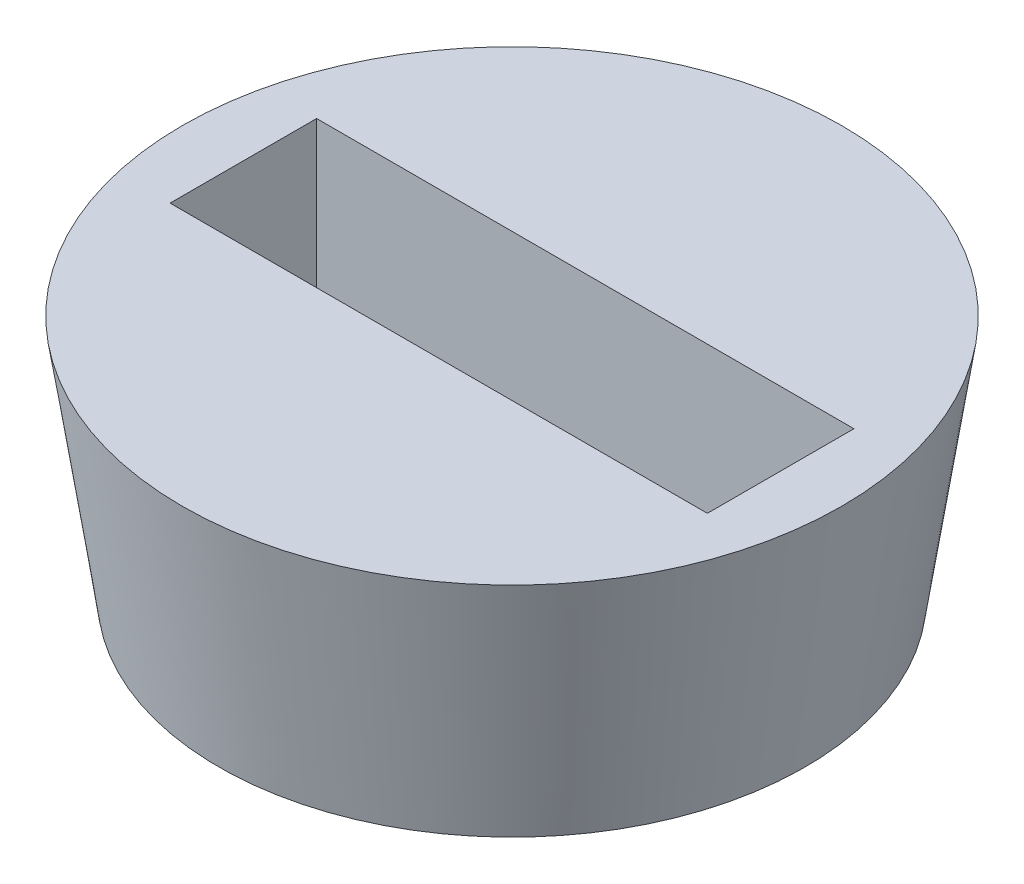
ISO-10303-21;
HEADER;
FILE_DESCRIPTION(('STEP AP214'),'2;1');
FILE_NAME('part.step','',(''),(''),'','','');
FILE_SCHEMA(('AUTOMOTIVE_DESIGN { 1 0 10303 214 1 1 1 1 }'));
ENDSEC;
DATA;
#1=APPLICATION_CONTEXT('core data for automotive mechanical design processes');
#2=APPLICATION_PROTOCOL_DEFINITION('international standard','automotive_design',2000,#1);
#3=PRODUCT_CONTEXT('',#1,'mechanical');
#4=PRODUCT('Part','Part','',(#3));
#5=PRODUCT_RELATED_PRODUCT_CATEGORY('part','',(#4));
#6=PRODUCT_DEFINITION_FORMATION('','',#4);
#7=PRODUCT_DEFINITION_CONTEXT('part definition',#1,'design');
#8=PRODUCT_DEFINITION('design','',#6,#7);
#9=PRODUCT_DEFINITION_SHAPE('','',#8);
#10=(LENGTH_UNIT() NAMED_UNIT(*) SI_UNIT(.MILLI.,.METRE.));
#11=(NAMED_UNIT(*) PLANE_ANGLE_UNIT() SI_UNIT($,.RADIAN.));
#12=(NAMED_UNIT(*) SI_UNIT($,.STERADIAN.) SOLID_ANGLE_UNIT());
#13=UNCERTAINTY_MEASURE_WITH_UNIT(LENGTH_MEASURE(1.E-05),#10,'distance_accuracy_value','');
#14=(GEOMETRIC_REPRESENTATION_CONTEXT(3) GLOBAL_UNCERTAINTY_ASSIGNED_CONTEXT((#13)) GLOBAL_UNIT_ASSIGNED_CONTEXT((#10,
#11,#12)) REPRESENTATION_CONTEXT('',''));
#15=CARTESIAN_POINT('',(0.,0.,0.));
#16=DIRECTION('',(0.,0.,1.));
#17=DIRECTION('',(1.,0.,0.));
#18=AXIS2_PLACEMENT_3D('',#15,#16,#17);
#19=CARTESIAN_POINT('',(6.,0.,0.));
#20=DIRECTION('',(0.,-1.,0.));
#21=DIRECTION('',(0.,0.,-1.));
#22=AXIS2_PLACEMENT_3D('',#19,#20,#21);
#23=PLANE('',#22);
#24=DIRECTION('',(0.,0.,1.));
#25=VECTOR('',#24,1.);
#26=CARTESIAN_POINT('',(-5.5,0.,-1.5));
#27=LINE('',#26,#25);
#28=CARTESIAN_POINT('',(-5.5,0.,-1.5));
#29=VERTEX_POINT('',#28);
#30=CARTESIAN_POINT('',(-5.5,0.,1.5));
#31=VERTEX_POINT('',#30);
#32=EDGE_CURVE('E75',#29,#31,#27,.T.);
#33=ORIENTED_EDGE('',*,*,#32,.T.);
#34=DIRECTION('',(1.,0.,0.));
#35=VECTOR('',#34,1.);
#36=CARTESIAN_POINT('',(5.5,0.,1.5));
#37=LINE('',#36,#35);
#38=CARTESIAN_POINT('',(5.5,0.,1.5));
#39=VERTEX_POINT('',#38);
#40=EDGE_CURVE('E84',#31,#39,#37,.T.);
#41=ORIENTED_EDGE('',*,*,#40,.T.);
#42=DIRECTION('',(0.,0.,-1.));
#43=VECTOR('',#42,1.);
#44=CARTESIAN_POINT('',(5.5,0.,-1.5));
#45=LINE('',#44,#43);
#46=CARTESIAN_POINT('',(5.5,0.,-1.5));
#47=VERTEX_POINT('',#46);
#48=EDGE_CURVE('E47',#39,#47,#45,.T.);
#49=ORIENTED_EDGE('',*,*,#48,.T.);
#50=DIRECTION('',(-1.,0.,0.));
#51=VECTOR('',#50,1.);
#52=CARTESIAN_POINT('',(5.5,0.,-1.5));
#53=LINE('',#52,#51);
#54=EDGE_CURVE('E81',#47,#29,#53,.T.);
#55=ORIENTED_EDGE('',*,*,#54,.T.);
#56=EDGE_LOOP('',(#33,#41,#49,#55));
#57=FACE_BOUND('',#56,.T.);
#58=CARTESIAN_POINT('',(0.,0.,0.));
#59=DIRECTION('',(0.,-1.,0.));
#60=DIRECTION('',(0.,0.,-1.));
#61=AXIS2_PLACEMENT_3D('',#58,#59,#60);
#62=CIRCLE('',#61,6.);
#63=CARTESIAN_POINT('',(0.,0.,-6.));
#64=VERTEX_POINT('',#63);
#65=EDGE_CURVE('E40',#64,#64,#62,.T.);
#66=ORIENTED_EDGE('',*,*,#65,.T.);
#67=EDGE_LOOP('',(#66));
#68=FACE_BOUND('',#67,.T.);
#69=ADVANCED_FACE('F33',(#57,#68),#23,.T.);
#70=CARTESIAN_POINT('',(0.,5.,0.));
#71=DIRECTION('',(0.,1.,0.));
#72=DIRECTION('',(0.,0.,1.));
#73=AXIS2_PLACEMENT_3D('',#70,#71,#72);
#74=PLANE('',#73);
#75=DIRECTION('',(0.,0.,1.));
#76=VECTOR('',#75,1.);
#77=CARTESIAN_POINT('',(-5.5,5.,-1.5));
#78=LINE('',#77,#76);
#79=CARTESIAN_POINT('',(-5.5,5.,-1.5));
#80=VERTEX_POINT('',#79);
#81=CARTESIAN_POINT('',(-5.5,5.,1.5));
#82=VERTEX_POINT('',#81);
#83=EDGE_CURVE('E55',#80,#82,#78,.T.);
#84=ORIENTED_EDGE('',*,*,#83,.F.);
#85=DIRECTION('',(-1.,0.,0.));
#86=VECTOR('',#85,1.);
#87=CARTESIAN_POINT('',(5.5,5.,-1.5));
#88=LINE('',#87,#86);
#89=CARTESIAN_POINT('',(5.5,5.,-1.5));
#90=VERTEX_POINT('',#89);
#91=EDGE_CURVE('E90',#90,#80,#88,.T.);
#92=ORIENTED_EDGE('',*,*,#91,.F.);
#93=DIRECTION('',(0.,0.,-1.));
#94=VECTOR('',#93,1.);
#95=CARTESIAN_POINT('',(5.5,5.,-1.5));
#96=LINE('',#95,#94);
#97=CARTESIAN_POINT('',(5.5,5.,1.5));
#98=VERTEX_POINT('',#97);
#99=EDGE_CURVE('E93',#98,#90,#96,.T.);
#100=ORIENTED_EDGE('',*,*,#99,.F.);
#101=DIRECTION('',(1.,0.,0.));
#102=VECTOR('',#101,1.);
#103=CARTESIAN_POINT('',(5.5,5.,1.5));
#104=LINE('',#103,#102);
#105=EDGE_CURVE('E99',#82,#98,#104,.T.);
#106=ORIENTED_EDGE('',*,*,#105,.F.);
#107=EDGE_LOOP('',(#84,#92,#100,#106));
#108=FACE_BOUND('',#107,.T.);
#109=CARTESIAN_POINT('',(0.,5.,0.));
#110=DIRECTION('',(0.,-1.,0.));
#111=DIRECTION('',(0.,0.,-1.));
#112=AXIS2_PLACEMENT_3D('',#109,#110,#111);
#113=CIRCLE('',#112,6.75);
#114=CARTESIAN_POINT('',(0.,5.,-6.75));
#115=VERTEX_POINT('',#114);
#116=EDGE_CURVE('E11',#115,#115,#113,.T.);
#117=ORIENTED_EDGE('',*,*,#116,.F.);
#118=EDGE_LOOP('',(#117));
#119=FACE_BOUND('',#118,.T.);
#120=ADVANCED_FACE('F112',(#108,#119),#74,.T.);
#121=CARTESIAN_POINT('',(0.,0.,0.));
#122=DIRECTION('',(0.,1.,0.));
#123=DIRECTION('',(0.,0.,1.));
#124=AXIS2_PLACEMENT_3D('',#121,#122,#123);
#125=CONICAL_SURFACE('',#124,6.,0.148889947609497);
#126=ORIENTED_EDGE('',*,*,#116,.T.);
#127=EDGE_LOOP('',(#126));
#128=FACE_BOUND('',#127,.T.);
#129=ORIENTED_EDGE('',*,*,#65,.F.);
#130=EDGE_LOOP('',(#129));
#131=FACE_BOUND('',#130,.T.);
#132=ADVANCED_FACE('F110',(#128,#131),#125,.T.);
#133=CARTESIAN_POINT('',(-5.5,0.,-1.5));
#134=DIRECTION('',(-1.,0.,0.));
#135=DIRECTION('',(0.,0.,1.));
#136=AXIS2_PLACEMENT_3D('',#133,#134,#135);
#137=PLANE('',#136);
#138=ORIENTED_EDGE('',*,*,#83,.T.);
#139=DIRECTION('',(0.,1.,0.));
#140=VECTOR('',#139,1.);
#141=CARTESIAN_POINT('',(-5.5,0.,1.5));
#142=LINE('',#141,#140);
#143=EDGE_CURVE('E71',#31,#82,#142,.T.);
#144=ORIENTED_EDGE('',*,*,#143,.F.);
#145=ORIENTED_EDGE('',*,*,#32,.F.);
#146=DIRECTION('',(0.,1.,0.));
#147=VECTOR('',#146,1.);
#148=CARTESIAN_POINT('',(-5.5,0.,-1.5));
#149=LINE('',#148,#147);
#150=EDGE_CURVE('E103',#29,#80,#149,.T.);
#151=ORIENTED_EDGE('',*,*,#150,.T.);
#152=EDGE_LOOP('',(#138,#144,#145,#151));
#153=FACE_BOUND('',#152,.T.);
#154=ADVANCED_FACE('F73',(#153),#137,.F.);
#155=CARTESIAN_POINT('',(5.5,0.,-1.5));
#156=DIRECTION('',(0.,0.,-1.));
#157=DIRECTION('',(-1.,0.,0.));
#158=AXIS2_PLACEMENT_3D('',#155,#156,#157);
#159=PLANE('',#158);
#160=ORIENTED_EDGE('',*,*,#91,.T.);
#161=ORIENTED_EDGE('',*,*,#150,.F.);
#162=ORIENTED_EDGE('',*,*,#54,.F.);
#163=DIRECTION('',(0.,1.,0.));
#164=VECTOR('',#163,1.);
#165=CARTESIAN_POINT('',(5.5,0.,-1.5));
#166=LINE('',#165,#164);
#167=EDGE_CURVE('E105',#47,#90,#166,.T.);
#168=ORIENTED_EDGE('',*,*,#167,.T.);
#169=EDGE_LOOP('',(#160,#161,#162,#168));
#170=FACE_BOUND('',#169,.T.);
#171=ADVANCED_FACE('F119',(#170),#159,.F.);
#172=CARTESIAN_POINT('',(5.5,0.,-1.5));
#173=DIRECTION('',(1.,0.,0.));
#174=DIRECTION('',(0.,0.,-1.));
#175=AXIS2_PLACEMENT_3D('',#172,#173,#174);
#176=PLANE('',#175);
#177=ORIENTED_EDGE('',*,*,#99,.T.);
#178=ORIENTED_EDGE('',*,*,#167,.F.);
#179=ORIENTED_EDGE('',*,*,#48,.F.);
#180=DIRECTION('',(0.,1.,0.));
#181=VECTOR('',#180,1.);
#182=CARTESIAN_POINT('',(5.5,0.,1.5));
#183=LINE('',#182,#181);
#184=EDGE_CURVE('E80',#39,#98,#183,.T.);
#185=ORIENTED_EDGE('',*,*,#184,.T.);
#186=EDGE_LOOP('',(#177,#178,#179,#185));
#187=FACE_BOUND('',#186,.T.);
#188=ADVANCED_FACE('F145',(#187),#176,.F.);
#189=CARTESIAN_POINT('',(5.5,0.,1.5));
#190=DIRECTION('',(0.,0.,1.));
#191=DIRECTION('',(1.,0.,0.));
#192=AXIS2_PLACEMENT_3D('',#189,#190,#191);
#193=PLANE('',#192);
#194=ORIENTED_EDGE('',*,*,#105,.T.);
#195=ORIENTED_EDGE('',*,*,#184,.F.);
#196=ORIENTED_EDGE('',*,*,#40,.F.);
#197=ORIENTED_EDGE('',*,*,#143,.T.);
#198=EDGE_LOOP('',(#194,#195,#196,#197));
#199=FACE_BOUND('',#198,.T.);
#200=ADVANCED_FACE('F85',(#199),#193,.F.);
#201=CLOSED_SHELL('',(#69,#120,#132,#154,#171,#188,#200));
#202=MANIFOLD_SOLID_BREP('B2',#201);
#203=ADVANCED_BREP_SHAPE_REPRESENTATION('',(#18,#202),#14);
#204=SHAPE_DEFINITION_REPRESENTATION(#9,#203);
ENDSEC;
END-ISO-10303-21;
